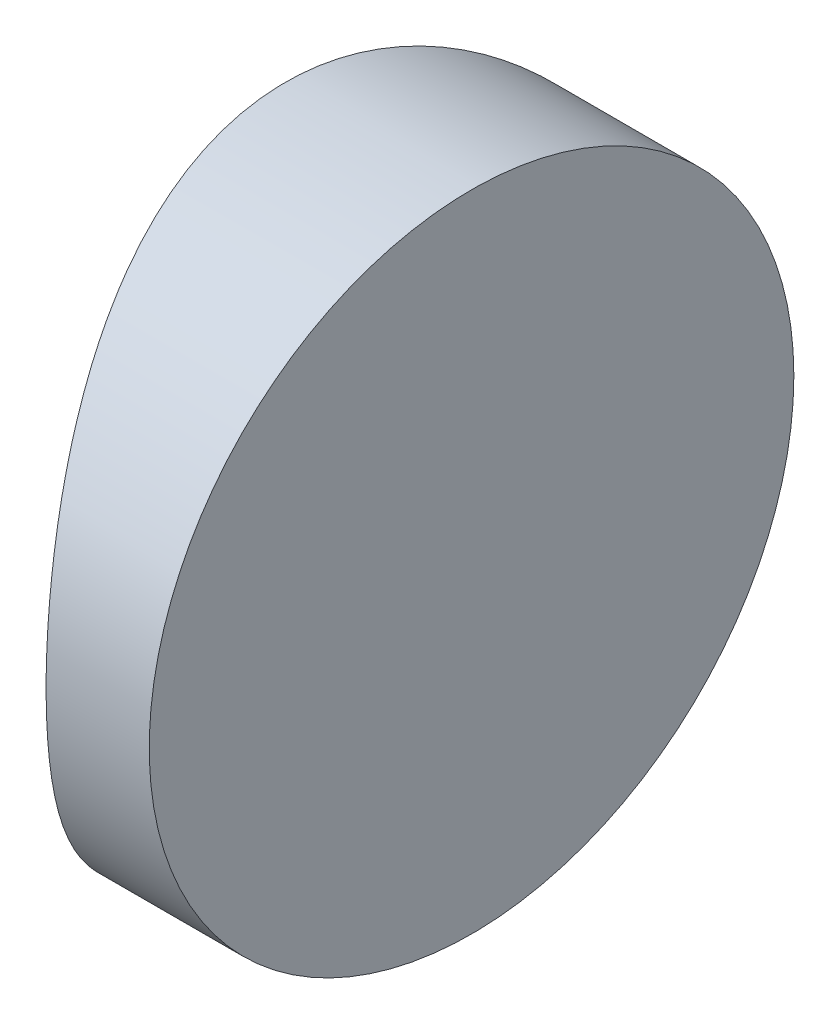
ISO-10303-21;
HEADER;
FILE_DESCRIPTION(('STEP AP214'),'2;1');
FILE_NAME('part.step','',(''),(''),'','','');
FILE_SCHEMA(('AUTOMOTIVE_DESIGN { 1 0 10303 214 1 1 1 1 }'));
ENDSEC;
DATA;
#1=APPLICATION_CONTEXT('core data for automotive mechanical design processes');
#2=APPLICATION_PROTOCOL_DEFINITION('international standard','automotive_design',2000,#1);
#3=PRODUCT_CONTEXT('',#1,'mechanical');
#4=PRODUCT('Part','Part','',(#3));
#5=PRODUCT_RELATED_PRODUCT_CATEGORY('part','',(#4));
#6=PRODUCT_DEFINITION_FORMATION('','',#4);
#7=PRODUCT_DEFINITION_CONTEXT('part definition',#1,'design');
#8=PRODUCT_DEFINITION('design','',#6,#7);
#9=PRODUCT_DEFINITION_SHAPE('','',#8);
#10=(LENGTH_UNIT() NAMED_UNIT(*) SI_UNIT(.MILLI.,.METRE.));
#11=(NAMED_UNIT(*) PLANE_ANGLE_UNIT() SI_UNIT($,.RADIAN.));
#12=(NAMED_UNIT(*) SI_UNIT($,.STERADIAN.) SOLID_ANGLE_UNIT());
#13=UNCERTAINTY_MEASURE_WITH_UNIT(LENGTH_MEASURE(1.E-05),#10,'distance_accuracy_value','');
#14=(GEOMETRIC_REPRESENTATION_CONTEXT(3) GLOBAL_UNCERTAINTY_ASSIGNED_CONTEXT((#13)) GLOBAL_UNIT_ASSIGNED_CONTEXT((#10,
#11,#12)) REPRESENTATION_CONTEXT('',''));
#15=CARTESIAN_POINT('',(0.,0.,0.));
#16=DIRECTION('',(0.,0.,1.));
#17=DIRECTION('',(1.,0.,0.));
#18=AXIS2_PLACEMENT_3D('',#15,#16,#17);
#19=CARTESIAN_POINT('',(4.35520433485127,12.5,0.));
#20=DIRECTION('',(0.,-1.,0.));
#21=DIRECTION('',(0.,0.,-1.));
#22=AXIS2_PLACEMENT_3D('',#19,#20,#21);
#23=CYLINDRICAL_SURFACE('',#22,12.93);
#24=CARTESIAN_POINT('',(-8.57479566514875,0.,0.));
#25=CARTESIAN_POINT('',(-8.57480160896341,-6.86780832910294E-06,-0.165208321889755));
#26=CARTESIAN_POINT('',(-8.5716252121803,0.00655258976294332,-0.330355676344645));
#27=CARTESIAN_POINT('',(-8.5590175555424,0.0326954507715595,-0.659422378818506));
#28=CARTESIAN_POINT('',(-8.54958564453993,0.0522802100364784,-0.823341597202072));
#29=CARTESIAN_POINT('',(-8.52470254239265,0.104260308964268,-1.14871521175683));
#30=CARTESIAN_POINT('',(-8.509249354259,0.136659898788261,-1.31016877169867));
#31=CARTESIAN_POINT('',(-8.47271599027047,0.213916967301136,-1.62947704347462));
#32=CARTESIAN_POINT('',(-8.45163360837332,0.258779330344178,-1.78733031800055));
#33=CARTESIAN_POINT('',(-8.40445202470963,0.360310310847264,-2.09776549265371));
#34=CARTESIAN_POINT('',(-8.37837156515438,0.416934885930087,-2.25036464960099));
#35=CARTESIAN_POINT('',(-8.32176801545848,0.541559043716947,-2.55001425785546));
#36=CARTESIAN_POINT('',(-8.29124323767796,0.60956294896228,-2.69706257451254));
#37=CARTESIAN_POINT('',(-8.1940455934301,0.829786008541602,-3.12855969348497));
#38=CARTESIAN_POINT('',(-8.12170760525872,0.99830345621535,-3.4036238928877));
#39=CARTESIAN_POINT('',(-7.9639006707987,1.38473285236511,-3.93786170275736));
#40=CARTESIAN_POINT('',(-7.87791615047498,1.60492602482732,-4.19521501977414));
#41=CARTESIAN_POINT('',(-7.70420973766278,2.08385186367074,-4.67114639440398));
#42=CARTESIAN_POINT('',(-7.61648656925919,2.34261381600321,-4.88969470794917));
#43=CARTESIAN_POINT('',(-7.48728118778306,2.76548784403033,-5.19169022984904));
#44=CARTESIAN_POINT('',(-7.44321477563859,2.91786847306468,-5.29080034446666));
#45=CARTESIAN_POINT('',(-7.35853494937779,3.23138413830044,-5.47572219711204));
#46=CARTESIAN_POINT('',(-7.31792013830109,3.39251558910113,-5.56153932686699));
#47=CARTESIAN_POINT('',(-7.24156918602816,3.72245398606732,-5.71903899750168));
#48=CARTESIAN_POINT('',(-7.20582841677545,3.89125344525408,-5.79073497601413));
#49=CARTESIAN_POINT('',(-7.14052981946686,4.23554404750173,-5.91930771585668));
#50=CARTESIAN_POINT('',(-7.11097019640283,4.41103323031204,-5.97618878062713));
#51=CARTESIAN_POINT('',(-7.06561802011054,4.72342070862077,-6.06229807494158));
#52=CARTESIAN_POINT('',(-7.04822794750485,4.85917127341276,-6.09488652892542));
#53=CARTESIAN_POINT('',(-7.01807545977818,5.13303825756775,-6.15096938096269));
#54=CARTESIAN_POINT('',(-7.00531239488599,5.27115434188557,-6.17446505594742));
#55=CARTESIAN_POINT('',(-6.98475229603166,5.5489972284662,-6.21214502326836));
#56=CARTESIAN_POINT('',(-6.97695446178532,5.68872376746169,-6.22633081616083));
#57=CARTESIAN_POINT('',(-6.96653477422151,5.9689637503423,-6.24525728169493));
#58=CARTESIAN_POINT('',(-6.96391141525307,6.10947695338899,-6.25000070184933));
#59=CARTESIAN_POINT('',(-6.96391319856213,6.41389474788237,-6.24999918141956));
#60=CARTESIAN_POINT('',(-6.96748383582031,6.57780288597335,-6.24354492979739));
#61=CARTESIAN_POINT('',(-6.98163413446436,6.90431092705028,-6.21781344158548));
#62=CARTESIAN_POINT('',(-6.99221457356366,7.06691068284949,-6.19853478217081));
#63=CARTESIAN_POINT('',(-7.02000057105618,7.38962529096495,-6.14739438456275));
#64=CARTESIAN_POINT('',(-7.03720955267924,7.54973881477552,-6.11552614441581));
#65=CARTESIAN_POINT('',(-7.07765320037318,7.86632283168831,-6.03957914035802));
#66=CARTESIAN_POINT('',(-7.10089035818828,8.02279178909505,-5.99549532662996));
#67=CARTESIAN_POINT('',(-7.15249243779035,8.33027439873236,-5.89584108503301));
#68=CARTESIAN_POINT('',(-7.18083132047866,8.48131128444432,-5.84032879033614));
#69=CARTESIAN_POINT('',(-7.24185471118642,8.77793975781282,-5.71819747993466));
#70=CARTESIAN_POINT('',(-7.27454089060483,8.923529223383,-5.65157418988732));
#71=CARTESIAN_POINT('',(-7.37774307658269,9.35096544559548,-5.43582986272275));
#72=CARTESIAN_POINT('',(-7.45344247609845,9.6237036672738,-5.27076114887703));
#73=CARTESIAN_POINT('',(-7.61711120847068,10.1594933402591,-4.88825758523498));
#74=CARTESIAN_POINT('',(-7.70557626593344,10.4202010586136,-4.66777929401356));
#75=CARTESIAN_POINT('',(-7.88085836964038,10.9028933309355,-4.18676785429058));
#76=CARTESIAN_POINT('',(-7.9676745153213,11.1248572376259,-3.92621348681126));
#77=CARTESIAN_POINT('',(-8.09281426877686,11.4307442285497,-3.50079219981223));
#78=CARTESIAN_POINT('',(-8.13481076491495,11.5306405256389,-3.34824196143417));
#79=CARTESIAN_POINT('',(-8.21478154931448,11.7171057175281,-3.03423018691193));
#80=CARTESIAN_POINT('',(-8.25275748977154,11.8036800934842,-2.87277235304534));
#81=CARTESIAN_POINT('',(-8.32356761521543,11.9626105555476,-2.54208637448379));
#82=CARTESIAN_POINT('',(-8.35640608986307,12.0349785166762,-2.37286486662879));
#83=CARTESIAN_POINT('',(-8.41599517444456,12.1647651616812,-2.02781665472872));
#84=CARTESIAN_POINT('',(-8.44274737975481,12.2221877637116,-1.85199169573909));
#85=CARTESIAN_POINT('',(-8.50135497727067,12.3469840194796,-1.4028743950351));
#86=CARTESIAN_POINT('',(-8.52872568523232,12.4042142729561,-1.12608465475451));
#87=CARTESIAN_POINT('',(-8.56543868167161,12.4807116286681,-0.566135910663382));
#88=CARTESIAN_POINT('',(-8.57478548423381,12.4999882364144,-0.282978519607477));
#89=CARTESIAN_POINT('',(-8.57480160896341,12.5000068678083,0.16520832188975));
#90=CARTESIAN_POINT('',(-8.5716252121803,12.4934474102371,0.33035567634464));
#91=CARTESIAN_POINT('',(-8.5590175555424,12.4673045492284,0.659422378818501));
#92=CARTESIAN_POINT('',(-8.54958564453993,12.4477197899635,0.823341597202067));
#93=CARTESIAN_POINT('',(-8.52470254239265,12.3957396910357,1.14871521175683));
#94=CARTESIAN_POINT('',(-8.509249354259,12.3633401012117,1.31016877169866));
#95=CARTESIAN_POINT('',(-8.47271599027046,12.2860830326989,1.62947704347461));
#96=CARTESIAN_POINT('',(-8.45163360837332,12.2412206696558,1.78733031800055));
#97=CARTESIAN_POINT('',(-8.40445202470963,12.1396896891527,2.09776549265371));
#98=CARTESIAN_POINT('',(-8.37837156515438,12.0830651140699,2.25036464960099));
#99=CARTESIAN_POINT('',(-8.32176801545848,11.9584409562831,2.55001425785546));
#100=CARTESIAN_POINT('',(-8.29124323767795,11.8904370510377,2.69706257451254));
#101=CARTESIAN_POINT('',(-8.1940455934301,11.6702139914584,3.12855969348497));
#102=CARTESIAN_POINT('',(-8.12170760525872,11.5016965437847,3.4036238928877));
#103=CARTESIAN_POINT('',(-7.9639006707987,11.1152671476349,3.93786170275735));
#104=CARTESIAN_POINT('',(-7.87791615047499,10.8950739751727,4.19521501977413));
#105=CARTESIAN_POINT('',(-7.70420973766278,10.4161481363293,4.67114639440398));
#106=CARTESIAN_POINT('',(-7.6164865692592,10.1573861839968,4.88969470794917));
#107=CARTESIAN_POINT('',(-7.48728118778306,9.73451215596967,5.19169022984903));
#108=CARTESIAN_POINT('',(-7.4432147756386,9.58213152693532,5.29080034446665));
#109=CARTESIAN_POINT('',(-7.3585349493778,9.26861586169957,5.47572219711204));
#110=CARTESIAN_POINT('',(-7.31792013830109,9.10748441089887,5.56153932686698));
#111=CARTESIAN_POINT('',(-7.24156918602817,8.77754601393269,5.71903899750167));
#112=CARTESIAN_POINT('',(-7.20582841677546,8.60874655474592,5.79073497601413));
#113=CARTESIAN_POINT('',(-7.14052981946686,8.26445595249827,5.91930771585668));
#114=CARTESIAN_POINT('',(-7.11097019640284,8.08896676968796,5.97618878062713));
#115=CARTESIAN_POINT('',(-7.06561802011054,7.77657929137923,6.06229807494157));
#116=CARTESIAN_POINT('',(-7.04822794750485,7.64082872658724,6.09488652892542));
#117=CARTESIAN_POINT('',(-7.01807545977818,7.36696174243225,6.15096938096269));
#118=CARTESIAN_POINT('',(-7.00531239488599,7.22884565811444,6.17446505594741));
#119=CARTESIAN_POINT('',(-6.98475229603166,6.95100277153381,6.21214502326836));
#120=CARTESIAN_POINT('',(-6.97695446178532,6.81127623253832,6.22633081616083));
#121=CARTESIAN_POINT('',(-6.96653477422151,6.5310362496577,6.24525728169493));
#122=CARTESIAN_POINT('',(-6.96391141525308,6.39052304661101,6.25000070184932));
#123=CARTESIAN_POINT('',(-6.96391319856214,6.08610525211763,6.24999918141955));
#124=CARTESIAN_POINT('',(-6.96748383582031,5.92219711402665,6.24354492979739));
#125=CARTESIAN_POINT('',(-6.98163413446436,5.59568907294972,6.21781344158548));
#126=CARTESIAN_POINT('',(-6.99221457356366,5.43308931715051,6.1985347821708));
#127=CARTESIAN_POINT('',(-7.02000057105618,5.11037470903505,6.14739438456274));
#128=CARTESIAN_POINT('',(-7.03720955267925,4.95026118522448,6.1155261444158));
#129=CARTESIAN_POINT('',(-7.07765320037318,4.63367716831169,6.03957914035802));
#130=CARTESIAN_POINT('',(-7.10089035818828,4.47720821090495,5.99549532662996));
#131=CARTESIAN_POINT('',(-7.15249243779035,4.16972560126764,5.89584108503301));
#132=CARTESIAN_POINT('',(-7.18083132047866,4.01868871555568,5.84032879033613));
#133=CARTESIAN_POINT('',(-7.24185471118643,3.72206024218719,5.71819747993466));
#134=CARTESIAN_POINT('',(-7.27454089060484,3.576470776617,5.65157418988731));
#135=CARTESIAN_POINT('',(-7.37774307658269,3.14903455440451,5.43582986272274));
#136=CARTESIAN_POINT('',(-7.45344247609845,2.8762963327262,5.27076114887702));
#137=CARTESIAN_POINT('',(-7.61711120847068,2.34050665974087,4.88825758523497));
#138=CARTESIAN_POINT('',(-7.70557626593344,2.07979894138637,4.66777929401355));
#139=CARTESIAN_POINT('',(-7.88085836964038,1.59710666906449,4.18676785429057));
#140=CARTESIAN_POINT('',(-7.96767451532131,1.37514276237407,3.92621348681125));
#141=CARTESIAN_POINT('',(-8.09281426877686,1.06925577145034,3.50079219981223));
#142=CARTESIAN_POINT('',(-8.13481076491495,0.969359474361054,3.34824196143416));
#143=CARTESIAN_POINT('',(-8.21478154931448,0.782894282471861,3.03423018691193));
#144=CARTESIAN_POINT('',(-8.25275748977154,0.696319906515787,2.87277235304533));
#145=CARTESIAN_POINT('',(-8.32356761521543,0.537389444452411,2.54208637448378));
#146=CARTESIAN_POINT('',(-8.35640608986308,0.465021483323799,2.37286486662879));
#147=CARTESIAN_POINT('',(-8.41599517444456,0.335234838318819,2.02781665472871));
#148=CARTESIAN_POINT('',(-8.44274737975481,0.277812236288431,1.85199169573908));
#149=CARTESIAN_POINT('',(-8.50135497727066,0.153015980520409,1.40287439503509));
#150=CARTESIAN_POINT('',(-8.52872568523232,0.0957857270439279,1.1260846547545));
#151=CARTESIAN_POINT('',(-8.56543868167161,0.0192883713318509,0.566135910663376));
#152=CARTESIAN_POINT('',(-8.57478548423381,1.17635855850792E-05,0.282978519607472));
#153=CARTESIAN_POINT('',(-8.57479566514875,0.,0.));
#154=B_SPLINE_CURVE_WITH_KNOTS('',3,(#24,#25,#26,#27,#28,#29,#30,#31,#32,#33,#34,#35,#36,#37,
#38,#39,#40,#41,#42,#43,#44,#45,#46,#47,#48,#49,#50,#51,#52,#53,#54,#55,#56,#57,#58,#59,#60,#61,
#62,#63,#64,#65,#66,#67,#68,#69,#70,#71,#72,#73,#74,#75,#76,#77,#78,#79,#80,#81,#82,#83,#84,#85,
#86,#87,#88,#89,#90,#91,#92,#93,#94,#95,#96,#97,#98,#99,#100,#101,#102,#103,#104,#105,#106,#107,
#108,#109,#110,#111,#112,#113,#114,#115,#116,#117,#118,#119,#120,#121,#122,#123,#124,#125,#126,
#127,#128,#129,#130,#131,#132,#133,#134,#135,#136,#137,#138,#139,#140,#141,#142,#143,#144,#145,
#146,#147,#148,#149,#150,#151,#152,#153),.UNSPECIFIED.,.T.,.F.,(4,2,2,2,2,2,2,2,2,2,2,2,2,2,2,2,
2,2,2,2,2,2,2,2,2,2,2,2,2,2,2,2,2,2,2,2,2,2,2,2,2,2,2,2,2,2,2,2,2,2,2,2,2,2,2,2,2,2,2,2,2,2,2,2,
4),(0.,0.495359974472284,0.990771519945966,1.48634751136005,1.9821180013684,2.47606455365179,
2.97019916370741,3.95763699258409,5.00179333279668,6.04674659680676,6.60728306961662,
7.16759158620715,7.7273643116091,8.286974252264,8.70867226366109,9.1303110329981,
9.55188182637463,9.97332993442912,10.4648730163714,10.9564706424637,11.4483224892813,
11.9403779677069,12.4299897546807,12.9197903291048,13.8986834569308,14.9525867715927,
16.0070500269021,16.5678057767078,17.1283301893348,17.6883840504337,18.2482909366302,
19.0969851859381,19.9454668522703,20.4408268267425,20.9362383722162,21.4318143636303,
21.9275848536386,22.421531405922,22.9156660159777,23.9031038448543,24.9472601850669,
25.992213449077,26.5527499218869,27.1130584384774,27.6728311638793,28.2324411045342,
28.6541391159313,29.0757778852683,29.4973486786449,29.9187967866994,30.4103398686416,
30.901937494734,31.3937893415515,31.8858448199772,32.3754566069509,32.8652571813751,
33.844150309201,34.898053623863,35.9525168791723,36.5132726289781,37.073797041605,
37.6338509027039,38.1937577889005,39.0424520382083,39.8909337045405),.UNSPECIFIED.);
#155=CARTESIAN_POINT('',(-8.57479566514875,0.,0.));
#156=VERTEX_POINT('',#155);
#157=EDGE_CURVE('E10',#156,#156,#154,.T.);
#158=ORIENTED_EDGE('',*,*,#157,.F.);
#159=EDGE_LOOP('',(#158));
#160=FACE_BOUND('',#159,.T.);
#161=ADVANCED_FACE('F33',(#160),#23,.T.);
#162=CARTESIAN_POINT('',(-4.96479566514874,12.5,-6.25));
#163=DIRECTION('',(1.,0.,0.));
#164=DIRECTION('',(0.,0.,-1.));
#165=AXIS2_PLACEMENT_3D('',#162,#163,#164);
#166=PLANE('',#165);
#167=CARTESIAN_POINT('',(-4.96479566514873,6.25,0.));
#168=DIRECTION('',(1.,0.,0.));
#169=DIRECTION('',(0.,0.,-1.));
#170=AXIS2_PLACEMENT_3D('',#167,#168,#169);
#171=CIRCLE('',#170,6.25);
#172=CARTESIAN_POINT('',(-4.96479566514874,6.25,-6.25));
#173=VERTEX_POINT('',#172);
#174=EDGE_CURVE('E43',#173,#173,#171,.T.);
#175=ORIENTED_EDGE('',*,*,#174,.T.);
#176=EDGE_LOOP('',(#175));
#177=FACE_BOUND('',#176,.T.);
#178=ADVANCED_FACE('F35',(#177),#166,.T.);
#179=CARTESIAN_POINT('',(-17.6647956651487,6.25,0.));
#180=DIRECTION('',(1.,0.,0.));
#181=DIRECTION('',(0.,0.,-1.));
#182=AXIS2_PLACEMENT_3D('',#179,#180,#181);
#183=CYLINDRICAL_SURFACE('',#182,6.25);
#184=ORIENTED_EDGE('',*,*,#174,.F.);
#185=EDGE_LOOP('',(#184));
#186=FACE_BOUND('',#185,.T.);
#187=ORIENTED_EDGE('',*,*,#157,.T.);
#188=EDGE_LOOP('',(#187));
#189=FACE_BOUND('',#188,.T.);
#190=ADVANCED_FACE('F50',(#186,#189),#183,.T.);
#191=CLOSED_SHELL('',(#161,#178,#190));
#192=MANIFOLD_SOLID_BREP('B2',#191);
#193=ADVANCED_BREP_SHAPE_REPRESENTATION('',(#18,#192),#14);
#194=SHAPE_DEFINITION_REPRESENTATION(#9,#193);
ENDSEC;
END-ISO-10303-21;
